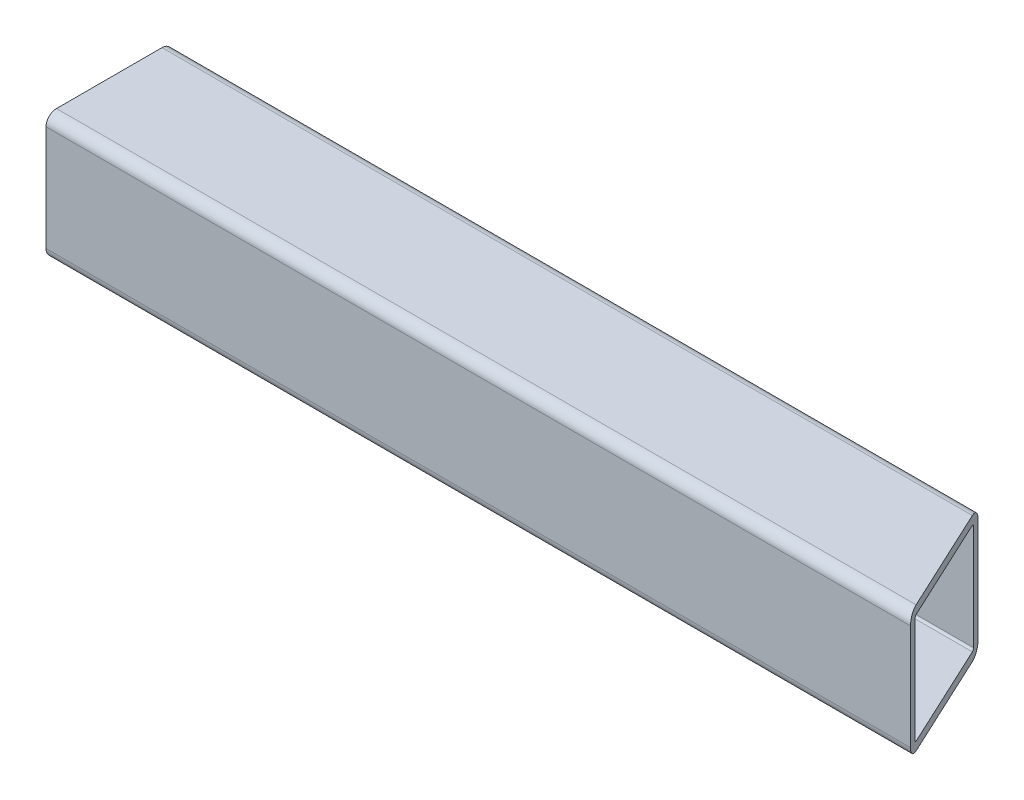
ISO-10303-21;
HEADER;
FILE_DESCRIPTION(('STEP AP214'),'2;1');
FILE_NAME('part.step','',(''),(''),'','','');
FILE_SCHEMA(('AUTOMOTIVE_DESIGN { 1 0 10303 214 1 1 1 1 }'));
ENDSEC;
DATA;
#1=APPLICATION_CONTEXT('core data for automotive mechanical design processes');
#2=APPLICATION_PROTOCOL_DEFINITION('international standard','automotive_design',2000,#1);
#3=PRODUCT_CONTEXT('',#1,'mechanical');
#4=PRODUCT('Part','Part','',(#3));
#5=PRODUCT_RELATED_PRODUCT_CATEGORY('part','',(#4));
#6=PRODUCT_DEFINITION_FORMATION('','',#4);
#7=PRODUCT_DEFINITION_CONTEXT('part definition',#1,'design');
#8=PRODUCT_DEFINITION('design','',#6,#7);
#9=PRODUCT_DEFINITION_SHAPE('','',#8);
#10=(LENGTH_UNIT() NAMED_UNIT(*) SI_UNIT(.MILLI.,.METRE.));
#11=(NAMED_UNIT(*) PLANE_ANGLE_UNIT() SI_UNIT($,.RADIAN.));
#12=(NAMED_UNIT(*) SI_UNIT($,.STERADIAN.) SOLID_ANGLE_UNIT());
#13=UNCERTAINTY_MEASURE_WITH_UNIT(LENGTH_MEASURE(1.E-05),#10,'distance_accuracy_value','');
#14=(GEOMETRIC_REPRESENTATION_CONTEXT(3) GLOBAL_UNCERTAINTY_ASSIGNED_CONTEXT((#13)) GLOBAL_UNIT_ASSIGNED_CONTEXT((#10,
#11,#12)) REPRESENTATION_CONTEXT('',''));
#15=CARTESIAN_POINT('',(0.,0.,0.));
#16=DIRECTION('',(0.,0.,1.));
#17=DIRECTION('',(1.,0.,0.));
#18=AXIS2_PLACEMENT_3D('',#15,#16,#17);
#19=CARTESIAN_POINT('',(-130.175,-15.875,15.875));
#20=DIRECTION('',(1.,0.,0.));
#21=DIRECTION('',(0.,0.,-1.));
#22=AXIS2_PLACEMENT_3D('',#19,#20,#21);
#23=PLANE('',#22);
#24=CARTESIAN_POINT('',(-130.175,-15.875,15.875));
#25=DIRECTION('',(1.,0.,0.));
#26=DIRECTION('',(0.,0.,-1.));
#27=AXIS2_PLACEMENT_3D('',#24,#25,#26);
#28=CIRCLE('',#27,3.175);
#29=CARTESIAN_POINT('',(-130.175,-15.875,19.05));
#30=VERTEX_POINT('',#29);
#31=CARTESIAN_POINT('',(-130.175,-19.05,15.875));
#32=VERTEX_POINT('',#31);
#33=EDGE_CURVE('E224',#30,#32,#28,.T.);
#34=ORIENTED_EDGE('',*,*,#33,.F.);
#35=DIRECTION('',(0.,-1.,0.));
#36=VECTOR('',#35,1.);
#37=CARTESIAN_POINT('',(-130.175,15.875,19.05));
#38=LINE('',#37,#36);
#39=CARTESIAN_POINT('',(-130.175,15.875,19.05));
#40=VERTEX_POINT('',#39);
#41=EDGE_CURVE('E203',#40,#30,#38,.T.);
#42=ORIENTED_EDGE('',*,*,#41,.F.);
#43=CARTESIAN_POINT('',(-130.175,15.875,15.875));
#44=DIRECTION('',(1.,0.,0.));
#45=DIRECTION('',(0.,0.,-1.));
#46=AXIS2_PLACEMENT_3D('',#43,#44,#45);
#47=CIRCLE('',#46,3.175);
#48=CARTESIAN_POINT('',(-130.175,19.05,15.875));
#49=VERTEX_POINT('',#48);
#50=EDGE_CURVE('E218',#49,#40,#47,.T.);
#51=ORIENTED_EDGE('',*,*,#50,.F.);
#52=DIRECTION('',(0.,0.,1.));
#53=VECTOR('',#52,1.);
#54=CARTESIAN_POINT('',(-130.175,19.05,15.875));
#55=LINE('',#54,#53);
#56=CARTESIAN_POINT('',(-130.175,19.05,-15.875));
#57=VERTEX_POINT('',#56);
#58=EDGE_CURVE('E238',#57,#49,#55,.T.);
#59=ORIENTED_EDGE('',*,*,#58,.F.);
#60=CARTESIAN_POINT('',(-130.175,15.875,-15.875));
#61=DIRECTION('',(1.,0.,0.));
#62=DIRECTION('',(0.,0.,-1.));
#63=AXIS2_PLACEMENT_3D('',#60,#61,#62);
#64=CIRCLE('',#63,3.175);
#65=CARTESIAN_POINT('',(-130.175,15.875,-19.05));
#66=VERTEX_POINT('',#65);
#67=EDGE_CURVE('E235',#66,#57,#64,.T.);
#68=ORIENTED_EDGE('',*,*,#67,.F.);
#69=DIRECTION('',(0.,1.,0.));
#70=VECTOR('',#69,1.);
#71=CARTESIAN_POINT('',(-130.175,15.875,-19.05));
#72=LINE('',#71,#70);
#73=CARTESIAN_POINT('',(-130.175,-15.875,-19.05));
#74=VERTEX_POINT('',#73);
#75=EDGE_CURVE('E232',#74,#66,#72,.T.);
#76=ORIENTED_EDGE('',*,*,#75,.F.);
#77=CARTESIAN_POINT('',(-130.175,-15.875,-15.875));
#78=DIRECTION('',(1.,0.,0.));
#79=DIRECTION('',(0.,0.,-1.));
#80=AXIS2_PLACEMENT_3D('',#77,#78,#79);
#81=CIRCLE('',#80,3.175);
#82=CARTESIAN_POINT('',(-130.175,-19.05,-15.875));
#83=VERTEX_POINT('',#82);
#84=EDGE_CURVE('E229',#83,#74,#81,.T.);
#85=ORIENTED_EDGE('',*,*,#84,.F.);
#86=DIRECTION('',(0.,0.,-1.));
#87=VECTOR('',#86,1.);
#88=CARTESIAN_POINT('',(-130.175,-19.05,15.875));
#89=LINE('',#88,#87);
#90=EDGE_CURVE('E226',#32,#83,#89,.T.);
#91=ORIENTED_EDGE('',*,*,#90,.F.);
#92=EDGE_LOOP('',(#34,#42,#51,#59,#68,#76,#85,#91));
#93=FACE_BOUND('',#92,.T.);
#94=CARTESIAN_POINT('',(-130.175,-15.875,15.875));
#95=DIRECTION('',(1.,0.,0.));
#96=DIRECTION('',(0.,0.,-1.));
#97=AXIS2_PLACEMENT_3D('',#94,#95,#96);
#98=CIRCLE('',#97,0.635000000000002);
#99=CARTESIAN_POINT('',(-130.175,-15.875,16.51));
#100=VERTEX_POINT('',#99);
#101=CARTESIAN_POINT('',(-130.175,-16.51,15.875));
#102=VERTEX_POINT('',#101);
#103=EDGE_CURVE('E212',#100,#102,#98,.T.);
#104=ORIENTED_EDGE('',*,*,#103,.T.);
#105=DIRECTION('',(0.,0.,-1.));
#106=VECTOR('',#105,1.);
#107=CARTESIAN_POINT('',(-130.175,-16.51,15.875));
#108=LINE('',#107,#106);
#109=CARTESIAN_POINT('',(-130.175,-16.51,-15.875));
#110=VERTEX_POINT('',#109);
#111=EDGE_CURVE('E268',#102,#110,#108,.T.);
#112=ORIENTED_EDGE('',*,*,#111,.T.);
#113=CARTESIAN_POINT('',(-130.175,-15.875,-15.875));
#114=DIRECTION('',(1.,0.,0.));
#115=DIRECTION('',(0.,0.,-1.));
#116=AXIS2_PLACEMENT_3D('',#113,#114,#115);
#117=CIRCLE('',#116,0.634999999999999);
#118=CARTESIAN_POINT('',(-130.175,-15.875,-16.51));
#119=VERTEX_POINT('',#118);
#120=EDGE_CURVE('E271',#110,#119,#117,.T.);
#121=ORIENTED_EDGE('',*,*,#120,.T.);
#122=DIRECTION('',(0.,1.,0.));
#123=VECTOR('',#122,1.);
#124=CARTESIAN_POINT('',(-130.175,15.875,-16.51));
#125=LINE('',#124,#123);
#126=CARTESIAN_POINT('',(-130.175,15.875,-16.51));
#127=VERTEX_POINT('',#126);
#128=EDGE_CURVE('E274',#119,#127,#125,.T.);
#129=ORIENTED_EDGE('',*,*,#128,.T.);
#130=CARTESIAN_POINT('',(-130.175,15.875,-15.875));
#131=DIRECTION('',(1.,0.,0.));
#132=DIRECTION('',(0.,0.,-1.));
#133=AXIS2_PLACEMENT_3D('',#130,#131,#132);
#134=CIRCLE('',#133,0.635000000000004);
#135=CARTESIAN_POINT('',(-130.175,16.51,-15.875));
#136=VERTEX_POINT('',#135);
#137=EDGE_CURVE('E277',#127,#136,#134,.T.);
#138=ORIENTED_EDGE('',*,*,#137,.T.);
#139=DIRECTION('',(0.,0.,1.));
#140=VECTOR('',#139,1.);
#141=CARTESIAN_POINT('',(-130.175,16.51,15.875));
#142=LINE('',#141,#140);
#143=CARTESIAN_POINT('',(-130.175,16.51,15.875));
#144=VERTEX_POINT('',#143);
#145=EDGE_CURVE('E280',#136,#144,#142,.T.);
#146=ORIENTED_EDGE('',*,*,#145,.T.);
#147=CARTESIAN_POINT('',(-130.175,15.875,15.875));
#148=DIRECTION('',(1.,0.,0.));
#149=DIRECTION('',(0.,0.,-1.));
#150=AXIS2_PLACEMENT_3D('',#147,#148,#149);
#151=CIRCLE('',#150,0.635000000000004);
#152=CARTESIAN_POINT('',(-130.175,15.875,16.51));
#153=VERTEX_POINT('',#152);
#154=EDGE_CURVE('E283',#144,#153,#151,.T.);
#155=ORIENTED_EDGE('',*,*,#154,.T.);
#156=DIRECTION('',(0.,-1.,0.));
#157=VECTOR('',#156,1.);
#158=CARTESIAN_POINT('',(-130.175,15.875,16.51));
#159=LINE('',#158,#157);
#160=EDGE_CURVE('E286',#153,#100,#159,.T.);
#161=ORIENTED_EDGE('',*,*,#160,.T.);
#162=EDGE_LOOP('',(#104,#112,#121,#129,#138,#146,#155,#161));
#163=FACE_BOUND('',#162,.T.);
#164=ADVANCED_FACE('F81',(#93,#163),#23,.F.);
#165=CARTESIAN_POINT('',(130.175,-15.875,15.875));
#166=DIRECTION('',(-1.,0.,0.));
#167=DIRECTION('',(0.,0.,1.));
#168=AXIS2_PLACEMENT_3D('',#165,#166,#167);
#169=CYLINDRICAL_SURFACE('',#168,3.175);
#170=DIRECTION('',(-1.,0.,0.));
#171=VECTOR('',#170,1.);
#172=CARTESIAN_POINT('',(130.175,-19.05,15.875));
#173=LINE('',#172,#171);
#174=CARTESIAN_POINT('',(128.694473185358,-19.05,15.875));
#175=VERTEX_POINT('',#174);
#176=EDGE_CURVE('E89',#175,#32,#173,.T.);
#177=ORIENTED_EDGE('',*,*,#176,.F.);
#178=CARTESIAN_POINT('',(128.694473185358,-15.875,15.875));
#179=DIRECTION('',(-0.906307787036652,0.,0.422618261740694));
#180=DIRECTION('',(-0.422618261740694,0.,-0.906307787036652));
#181=AXIS2_PLACEMENT_3D('',#178,#179,#180);
#182=ELLIPSE('',#181,3.5032248927059,3.175);
#183=CARTESIAN_POINT('',(130.175,-15.875,19.05));
#184=VERTEX_POINT('',#183);
#185=EDGE_CURVE('E210',#175,#184,#182,.T.);
#186=ORIENTED_EDGE('',*,*,#185,.T.);
#187=DIRECTION('',(-1.,0.,0.));
#188=VECTOR('',#187,1.);
#189=CARTESIAN_POINT('',(130.175,-15.875,19.05));
#190=LINE('',#189,#188);
#191=EDGE_CURVE('E195',#184,#30,#190,.T.);
#192=ORIENTED_EDGE('',*,*,#191,.T.);
#193=ORIENTED_EDGE('',*,*,#33,.T.);
#194=EDGE_LOOP('',(#177,#186,#192,#193));
#195=FACE_BOUND('',#194,.T.);
#196=ADVANCED_FACE('F83',(#195),#169,.T.);
#197=CARTESIAN_POINT('',(130.175,-19.05,15.875));
#198=DIRECTION('',(0.,1.,0.));
#199=DIRECTION('',(0.,0.,1.));
#200=AXIS2_PLACEMENT_3D('',#197,#198,#199);
#201=PLANE('',#200);
#202=DIRECTION('',(-1.,0.,0.));
#203=VECTOR('',#202,1.);
#204=CARTESIAN_POINT('',(130.175,-19.05,-15.875));
#205=LINE('',#204,#203);
#206=CARTESIAN_POINT('',(113.889205038937,-19.05,-15.875));
#207=VERTEX_POINT('',#206);
#208=EDGE_CURVE('E251',#207,#83,#205,.T.);
#209=ORIENTED_EDGE('',*,*,#208,.F.);
#210=DIRECTION('',(0.422618261740694,0.,0.906307787036652));
#211=VECTOR('',#210,1.);
#212=CARTESIAN_POINT('',(128.958904446549,-19.05,16.4420746696226));
#213=LINE('',#212,#211);
#214=EDGE_CURVE('E96',#207,#175,#213,.T.);
#215=ORIENTED_EDGE('',*,*,#214,.T.);
#216=ORIENTED_EDGE('',*,*,#176,.T.);
#217=ORIENTED_EDGE('',*,*,#90,.T.);
#218=EDGE_LOOP('',(#209,#215,#216,#217));
#219=FACE_BOUND('',#218,.T.);
#220=ADVANCED_FACE('F253',(#219),#201,.F.);
#221=CARTESIAN_POINT('',(130.175,-15.875,-15.875));
#222=DIRECTION('',(-1.,0.,0.));
#223=DIRECTION('',(0.,0.,1.));
#224=AXIS2_PLACEMENT_3D('',#221,#222,#223);
#225=CYLINDRICAL_SURFACE('',#224,3.175);
#226=DIRECTION('',(-1.,0.,0.));
#227=VECTOR('',#226,1.);
#228=CARTESIAN_POINT('',(130.175,-15.875,-19.05));
#229=LINE('',#228,#227);
#230=CARTESIAN_POINT('',(112.408678224295,-15.875,-19.05));
#231=VERTEX_POINT('',#230);
#232=EDGE_CURVE('E249',#231,#74,#229,.T.);
#233=ORIENTED_EDGE('',*,*,#232,.F.);
#234=CARTESIAN_POINT('',(113.889205038937,-15.875,-15.875));
#235=DIRECTION('',(-0.906307787036652,0.,0.422618261740694));
#236=DIRECTION('',(-0.422618261740694,0.,-0.906307787036652));
#237=AXIS2_PLACEMENT_3D('',#234,#235,#236);
#238=ELLIPSE('',#237,3.5032248927059,3.175);
#239=EDGE_CURVE('E104',#231,#207,#238,.T.);
#240=ORIENTED_EDGE('',*,*,#239,.T.);
#241=ORIENTED_EDGE('',*,*,#208,.T.);
#242=ORIENTED_EDGE('',*,*,#84,.T.);
#243=EDGE_LOOP('',(#233,#240,#241,#242));
#244=FACE_BOUND('',#243,.T.);
#245=ADVANCED_FACE('F259',(#244),#225,.T.);
#246=CARTESIAN_POINT('',(130.175,15.875,-19.05));
#247=DIRECTION('',(0.,0.,1.));
#248=DIRECTION('',(0.,-1.,0.));
#249=AXIS2_PLACEMENT_3D('',#246,#247,#248);
#250=PLANE('',#249);
#251=DIRECTION('',(-1.,0.,0.));
#252=VECTOR('',#251,1.);
#253=CARTESIAN_POINT('',(130.175,15.875,-19.05));
#254=LINE('',#253,#252);
#255=CARTESIAN_POINT('',(112.408678224295,15.875,-19.05));
#256=VERTEX_POINT('',#255);
#257=EDGE_CURVE('E247',#256,#66,#254,.T.);
#258=ORIENTED_EDGE('',*,*,#257,.F.);
#259=DIRECTION('',(0.,-1.,0.));
#260=VECTOR('',#259,1.);
#261=CARTESIAN_POINT('',(112.408678224295,399.008939970401,-19.05));
#262=LINE('',#261,#260);
#263=EDGE_CURVE('E337',#256,#231,#262,.T.);
#264=ORIENTED_EDGE('',*,*,#263,.T.);
#265=ORIENTED_EDGE('',*,*,#232,.T.);
#266=ORIENTED_EDGE('',*,*,#75,.T.);
#267=EDGE_LOOP('',(#258,#264,#265,#266));
#268=FACE_BOUND('',#267,.T.);
#269=ADVANCED_FACE('F336',(#268),#250,.F.);
#270=CARTESIAN_POINT('',(130.175,15.875,-15.875));
#271=DIRECTION('',(-1.,0.,0.));
#272=DIRECTION('',(0.,0.,1.));
#273=AXIS2_PLACEMENT_3D('',#270,#271,#272);
#274=CYLINDRICAL_SURFACE('',#273,3.175);
#275=DIRECTION('',(-1.,0.,0.));
#276=VECTOR('',#275,1.);
#277=CARTESIAN_POINT('',(130.175,19.05,-15.875));
#278=LINE('',#277,#276);
#279=CARTESIAN_POINT('',(113.889205038937,19.05,-15.875));
#280=VERTEX_POINT('',#279);
#281=EDGE_CURVE('E245',#280,#57,#278,.T.);
#282=ORIENTED_EDGE('',*,*,#281,.F.);
#283=CARTESIAN_POINT('',(113.889205038937,15.875,-15.875));
#284=DIRECTION('',(-0.906307787036652,0.,0.422618261740694));
#285=DIRECTION('',(-0.422618261740694,0.,-0.906307787036652));
#286=AXIS2_PLACEMENT_3D('',#283,#284,#285);
#287=ELLIPSE('',#286,3.50322489270591,3.175);
#288=EDGE_CURVE('E262',#280,#256,#287,.T.);
#289=ORIENTED_EDGE('',*,*,#288,.T.);
#290=ORIENTED_EDGE('',*,*,#257,.T.);
#291=ORIENTED_EDGE('',*,*,#67,.T.);
#292=EDGE_LOOP('',(#282,#289,#290,#291));
#293=FACE_BOUND('',#292,.T.);
#294=ADVANCED_FACE('F334',(#293),#274,.T.);
#295=CARTESIAN_POINT('',(130.175,19.05,15.875));
#296=DIRECTION('',(0.,-1.,0.));
#297=DIRECTION('',(0.,0.,-1.));
#298=AXIS2_PLACEMENT_3D('',#295,#296,#297);
#299=PLANE('',#298);
#300=DIRECTION('',(-1.,0.,0.));
#301=VECTOR('',#300,1.);
#302=CARTESIAN_POINT('',(130.175,19.05,15.875));
#303=LINE('',#302,#301);
#304=CARTESIAN_POINT('',(128.694473185358,19.05,15.875));
#305=VERTEX_POINT('',#304);
#306=EDGE_CURVE('E243',#305,#49,#303,.T.);
#307=ORIENTED_EDGE('',*,*,#306,.F.);
#308=DIRECTION('',(-0.422618261740694,0.,-0.906307787036652));
#309=VECTOR('',#308,1.);
#310=CARTESIAN_POINT('',(128.958904446549,19.05,16.4420746696226));
#311=LINE('',#310,#309);
#312=EDGE_CURVE('E324',#305,#280,#311,.T.);
#313=ORIENTED_EDGE('',*,*,#312,.T.);
#314=ORIENTED_EDGE('',*,*,#281,.T.);
#315=ORIENTED_EDGE('',*,*,#58,.T.);
#316=EDGE_LOOP('',(#307,#313,#314,#315));
#317=FACE_BOUND('',#316,.T.);
#318=ADVANCED_FACE('F388',(#317),#299,.F.);
#319=CARTESIAN_POINT('',(130.175,15.875,15.875));
#320=DIRECTION('',(-1.,0.,0.));
#321=DIRECTION('',(0.,0.,1.));
#322=AXIS2_PLACEMENT_3D('',#319,#320,#321);
#323=CYLINDRICAL_SURFACE('',#322,3.175);
#324=DIRECTION('',(-1.,0.,0.));
#325=VECTOR('',#324,1.);
#326=CARTESIAN_POINT('',(130.175,15.875,19.05));
#327=LINE('',#326,#325);
#328=CARTESIAN_POINT('',(130.175,15.875,19.05));
#329=VERTEX_POINT('',#328);
#330=EDGE_CURVE('E207',#329,#40,#327,.T.);
#331=ORIENTED_EDGE('',*,*,#330,.F.);
#332=CARTESIAN_POINT('',(128.694473185358,15.875,15.875));
#333=DIRECTION('',(-0.906307787036652,0.,0.422618261740694));
#334=DIRECTION('',(-0.422618261740694,0.,-0.906307787036652));
#335=AXIS2_PLACEMENT_3D('',#332,#333,#334);
#336=ELLIPSE('',#335,3.50322489270591,3.175);
#337=EDGE_CURVE('E216',#329,#305,#336,.T.);
#338=ORIENTED_EDGE('',*,*,#337,.T.);
#339=ORIENTED_EDGE('',*,*,#306,.T.);
#340=ORIENTED_EDGE('',*,*,#50,.T.);
#341=EDGE_LOOP('',(#331,#338,#339,#340));
#342=FACE_BOUND('',#341,.T.);
#343=ADVANCED_FACE('F385',(#342),#323,.T.);
#344=CARTESIAN_POINT('',(130.175,15.875,19.05));
#345=DIRECTION('',(0.,0.,-1.));
#346=DIRECTION('',(0.,1.,0.));
#347=AXIS2_PLACEMENT_3D('',#344,#345,#346);
#348=PLANE('',#347);
#349=ORIENTED_EDGE('',*,*,#41,.T.);
#350=ORIENTED_EDGE('',*,*,#191,.F.);
#351=DIRECTION('',(0.,-1.,0.));
#352=VECTOR('',#351,1.);
#353=CARTESIAN_POINT('',(130.175,15.875,19.05));
#354=LINE('',#353,#352);
#355=EDGE_CURVE('E200',#329,#184,#354,.T.);
#356=ORIENTED_EDGE('',*,*,#355,.F.);
#357=ORIENTED_EDGE('',*,*,#330,.T.);
#358=EDGE_LOOP('',(#349,#350,#356,#357));
#359=FACE_BOUND('',#358,.T.);
#360=ADVANCED_FACE('F197',(#359),#348,.F.);
#361=CARTESIAN_POINT('',(130.175,-15.875,15.875));
#362=DIRECTION('',(-1.,0.,0.));
#363=DIRECTION('',(0.,0.,1.));
#364=AXIS2_PLACEMENT_3D('',#361,#362,#363);
#365=CYLINDRICAL_SURFACE('',#364,0.635000000000002);
#366=CARTESIAN_POINT('',(128.694473185358,-15.875,15.875));
#367=DIRECTION('',(-0.906307787036652,0.,0.422618261740694));
#368=DIRECTION('',(-0.422618261740694,0.,-0.906307787036652));
#369=AXIS2_PLACEMENT_3D('',#366,#367,#368);
#370=ELLIPSE('',#369,0.700644978541183,0.635000000000002);
#371=CARTESIAN_POINT('',(128.694473185358,-16.51,15.875));
#372=VERTEX_POINT('',#371);
#373=CARTESIAN_POINT('',(128.990578548286,-15.875,16.51));
#374=VERTEX_POINT('',#373);
#375=EDGE_CURVE('E311',#372,#374,#370,.T.);
#376=ORIENTED_EDGE('',*,*,#375,.F.);
#377=DIRECTION('',(-1.,0.,0.));
#378=VECTOR('',#377,1.);
#379=CARTESIAN_POINT('',(130.175,-16.51,15.875));
#380=LINE('',#379,#378);
#381=EDGE_CURVE('E222',#372,#102,#380,.T.);
#382=ORIENTED_EDGE('',*,*,#381,.T.);
#383=ORIENTED_EDGE('',*,*,#103,.F.);
#384=DIRECTION('',(-1.,0.,0.));
#385=VECTOR('',#384,1.);
#386=CARTESIAN_POINT('',(130.175,-15.875,16.51));
#387=LINE('',#386,#385);
#388=EDGE_CURVE('E289',#374,#100,#387,.T.);
#389=ORIENTED_EDGE('',*,*,#388,.F.);
#390=EDGE_LOOP('',(#376,#382,#383,#389));
#391=FACE_BOUND('',#390,.T.);
#392=ADVANCED_FACE('F308',(#391),#365,.F.);
#393=CARTESIAN_POINT('',(130.175,-16.51,15.875));
#394=DIRECTION('',(0.,1.,0.));
#395=DIRECTION('',(0.,0.,1.));
#396=AXIS2_PLACEMENT_3D('',#393,#394,#395);
#397=PLANE('',#396);
#398=DIRECTION('',(0.422618261740694,0.,0.906307787036652));
#399=VECTOR('',#398,1.);
#400=CARTESIAN_POINT('',(128.958904446549,-16.51,16.4420746696226));
#401=LINE('',#400,#399);
#402=CARTESIAN_POINT('',(113.889205038937,-16.51,-15.875));
#403=VERTEX_POINT('',#402);
#404=EDGE_CURVE('E322',#403,#372,#401,.T.);
#405=ORIENTED_EDGE('',*,*,#404,.F.);
#406=DIRECTION('',(-1.,0.,0.));
#407=VECTOR('',#406,1.);
#408=CARTESIAN_POINT('',(130.175,-16.51,-15.875));
#409=LINE('',#408,#407);
#410=EDGE_CURVE('E300',#403,#110,#409,.T.);
#411=ORIENTED_EDGE('',*,*,#410,.T.);
#412=ORIENTED_EDGE('',*,*,#111,.F.);
#413=ORIENTED_EDGE('',*,*,#381,.F.);
#414=EDGE_LOOP('',(#405,#411,#412,#413));
#415=FACE_BOUND('',#414,.T.);
#416=ADVANCED_FACE('F313',(#415),#397,.T.);
#417=CARTESIAN_POINT('',(130.175,-15.875,-15.875));
#418=DIRECTION('',(-1.,0.,0.));
#419=DIRECTION('',(0.,0.,1.));
#420=AXIS2_PLACEMENT_3D('',#417,#418,#419);
#421=CYLINDRICAL_SURFACE('',#420,0.634999999999999);
#422=CARTESIAN_POINT('',(113.889205038937,-15.875,-15.875));
#423=DIRECTION('',(-0.906307787036652,0.,0.422618261740694));
#424=DIRECTION('',(-0.422618261740694,0.,-0.906307787036652));
#425=AXIS2_PLACEMENT_3D('',#422,#423,#424);
#426=ELLIPSE('',#425,0.700644978541179,0.634999999999999);
#427=CARTESIAN_POINT('',(113.593099676009,-15.875,-16.51));
#428=VERTEX_POINT('',#427);
#429=EDGE_CURVE('E326',#428,#403,#426,.T.);
#430=ORIENTED_EDGE('',*,*,#429,.F.);
#431=DIRECTION('',(-1.,0.,0.));
#432=VECTOR('',#431,1.);
#433=CARTESIAN_POINT('',(130.175,-15.875,-16.51));
#434=LINE('',#433,#432);
#435=EDGE_CURVE('E299',#428,#119,#434,.T.);
#436=ORIENTED_EDGE('',*,*,#435,.T.);
#437=ORIENTED_EDGE('',*,*,#120,.F.);
#438=ORIENTED_EDGE('',*,*,#410,.F.);
#439=EDGE_LOOP('',(#430,#436,#437,#438));
#440=FACE_BOUND('',#439,.T.);
#441=ADVANCED_FACE('F352',(#440),#421,.F.);
#442=CARTESIAN_POINT('',(130.175,15.875,-16.51));
#443=DIRECTION('',(0.,0.,1.));
#444=DIRECTION('',(0.,-1.,0.));
#445=AXIS2_PLACEMENT_3D('',#442,#443,#444);
#446=PLANE('',#445);
#447=DIRECTION('',(0.,-1.,0.));
#448=VECTOR('',#447,1.);
#449=CARTESIAN_POINT('',(113.593099676009,15.875,-16.51));
#450=LINE('',#449,#448);
#451=CARTESIAN_POINT('',(113.593099676009,15.875,-16.51));
#452=VERTEX_POINT('',#451);
#453=EDGE_CURVE('E348',#452,#428,#450,.T.);
#454=ORIENTED_EDGE('',*,*,#453,.F.);
#455=DIRECTION('',(-1.,0.,0.));
#456=VECTOR('',#455,1.);
#457=CARTESIAN_POINT('',(130.175,15.875,-16.51));
#458=LINE('',#457,#456);
#459=EDGE_CURVE('E297',#452,#127,#458,.T.);
#460=ORIENTED_EDGE('',*,*,#459,.T.);
#461=ORIENTED_EDGE('',*,*,#128,.F.);
#462=ORIENTED_EDGE('',*,*,#435,.F.);
#463=EDGE_LOOP('',(#454,#460,#461,#462));
#464=FACE_BOUND('',#463,.T.);
#465=ADVANCED_FACE('F355',(#464),#446,.T.);
#466=CARTESIAN_POINT('',(130.175,15.875,-15.875));
#467=DIRECTION('',(-1.,0.,0.));
#468=DIRECTION('',(0.,0.,1.));
#469=AXIS2_PLACEMENT_3D('',#466,#467,#468);
#470=CYLINDRICAL_SURFACE('',#469,0.635000000000004);
#471=CARTESIAN_POINT('',(113.889205038937,15.875,-15.875));
#472=DIRECTION('',(-0.906307787036652,0.,0.422618261740694));
#473=DIRECTION('',(-0.422618261740694,0.,-0.906307787036652));
#474=AXIS2_PLACEMENT_3D('',#471,#472,#473);
#475=ELLIPSE('',#474,0.700644978541185,0.635000000000004);
#476=CARTESIAN_POINT('',(113.889205038937,16.51,-15.875));
#477=VERTEX_POINT('',#476);
#478=EDGE_CURVE('E345',#477,#452,#475,.T.);
#479=ORIENTED_EDGE('',*,*,#478,.F.);
#480=DIRECTION('',(-1.,0.,0.));
#481=VECTOR('',#480,1.);
#482=CARTESIAN_POINT('',(130.175,16.51,-15.875));
#483=LINE('',#482,#481);
#484=EDGE_CURVE('E295',#477,#136,#483,.T.);
#485=ORIENTED_EDGE('',*,*,#484,.T.);
#486=ORIENTED_EDGE('',*,*,#137,.F.);
#487=ORIENTED_EDGE('',*,*,#459,.F.);
#488=EDGE_LOOP('',(#479,#485,#486,#487));
#489=FACE_BOUND('',#488,.T.);
#490=ADVANCED_FACE('F360',(#489),#470,.F.);
#491=CARTESIAN_POINT('',(130.175,16.51,15.875));
#492=DIRECTION('',(0.,-1.,0.));
#493=DIRECTION('',(0.,0.,-1.));
#494=AXIS2_PLACEMENT_3D('',#491,#492,#493);
#495=PLANE('',#494);
#496=DIRECTION('',(-0.422618261740694,0.,-0.906307787036652));
#497=VECTOR('',#496,1.);
#498=CARTESIAN_POINT('',(128.958904446549,16.51,16.4420746696226));
#499=LINE('',#498,#497);
#500=CARTESIAN_POINT('',(128.694473185358,16.51,15.875));
#501=VERTEX_POINT('',#500);
#502=EDGE_CURVE('E340',#501,#477,#499,.T.);
#503=ORIENTED_EDGE('',*,*,#502,.F.);
#504=DIRECTION('',(-1.,0.,0.));
#505=VECTOR('',#504,1.);
#506=CARTESIAN_POINT('',(130.175,16.51,15.875));
#507=LINE('',#506,#505);
#508=EDGE_CURVE('E293',#501,#144,#507,.T.);
#509=ORIENTED_EDGE('',*,*,#508,.T.);
#510=ORIENTED_EDGE('',*,*,#145,.F.);
#511=ORIENTED_EDGE('',*,*,#484,.F.);
#512=EDGE_LOOP('',(#503,#509,#510,#511));
#513=FACE_BOUND('',#512,.T.);
#514=ADVANCED_FACE('F363',(#513),#495,.T.);
#515=CARTESIAN_POINT('',(130.175,15.875,15.875));
#516=DIRECTION('',(-1.,0.,0.));
#517=DIRECTION('',(0.,0.,1.));
#518=AXIS2_PLACEMENT_3D('',#515,#516,#517);
#519=CYLINDRICAL_SURFACE('',#518,0.635000000000004);
#520=CARTESIAN_POINT('',(128.694473185358,15.875,15.875));
#521=DIRECTION('',(-0.906307787036652,0.,0.422618261740694));
#522=DIRECTION('',(-0.422618261740694,0.,-0.906307787036652));
#523=AXIS2_PLACEMENT_3D('',#520,#521,#522);
#524=ELLIPSE('',#523,0.700644978541185,0.635000000000004);
#525=CARTESIAN_POINT('',(128.990578548286,15.875,16.51));
#526=VERTEX_POINT('',#525);
#527=EDGE_CURVE('E338',#526,#501,#524,.T.);
#528=ORIENTED_EDGE('',*,*,#527,.F.);
#529=DIRECTION('',(-1.,0.,0.));
#530=VECTOR('',#529,1.);
#531=CARTESIAN_POINT('',(130.175,15.875,16.51));
#532=LINE('',#531,#530);
#533=EDGE_CURVE('E291',#526,#153,#532,.T.);
#534=ORIENTED_EDGE('',*,*,#533,.T.);
#535=ORIENTED_EDGE('',*,*,#154,.F.);
#536=ORIENTED_EDGE('',*,*,#508,.F.);
#537=EDGE_LOOP('',(#528,#534,#535,#536));
#538=FACE_BOUND('',#537,.T.);
#539=ADVANCED_FACE('F366',(#538),#519,.F.);
#540=CARTESIAN_POINT('',(130.175,15.875,16.51));
#541=DIRECTION('',(0.,0.,-1.));
#542=DIRECTION('',(0.,1.,0.));
#543=AXIS2_PLACEMENT_3D('',#540,#541,#542);
#544=PLANE('',#543);
#545=DIRECTION('',(0.,1.,0.));
#546=VECTOR('',#545,1.);
#547=CARTESIAN_POINT('',(128.990578548286,15.875,16.51));
#548=LINE('',#547,#546);
#549=EDGE_CURVE('E12',#374,#526,#548,.T.);
#550=ORIENTED_EDGE('',*,*,#549,.F.);
#551=ORIENTED_EDGE('',*,*,#388,.T.);
#552=ORIENTED_EDGE('',*,*,#160,.F.);
#553=ORIENTED_EDGE('',*,*,#533,.F.);
#554=EDGE_LOOP('',(#550,#551,#552,#553));
#555=FACE_BOUND('',#554,.T.);
#556=ADVANCED_FACE('F317',(#555),#544,.T.);
#557=CARTESIAN_POINT('',(130.175,399.008939970401,19.05));
#558=DIRECTION('',(-0.906307787036652,0.,0.422618261740694));
#559=DIRECTION('',(0.422618261740694,0.,0.906307787036652));
#560=AXIS2_PLACEMENT_3D('',#557,#558,#559);
#561=PLANE('',#560);
#562=ORIENTED_EDGE('',*,*,#404,.T.);
#563=ORIENTED_EDGE('',*,*,#375,.T.);
#564=ORIENTED_EDGE('',*,*,#549,.T.);
#565=ORIENTED_EDGE('',*,*,#527,.T.);
#566=ORIENTED_EDGE('',*,*,#502,.T.);
#567=ORIENTED_EDGE('',*,*,#478,.T.);
#568=ORIENTED_EDGE('',*,*,#453,.T.);
#569=ORIENTED_EDGE('',*,*,#429,.T.);
#570=EDGE_LOOP('',(#562,#563,#564,#565,#566,#567,#568,#569));
#571=FACE_BOUND('',#570,.T.);
#572=ORIENTED_EDGE('',*,*,#185,.F.);
#573=ORIENTED_EDGE('',*,*,#214,.F.);
#574=ORIENTED_EDGE('',*,*,#239,.F.);
#575=ORIENTED_EDGE('',*,*,#263,.F.);
#576=ORIENTED_EDGE('',*,*,#288,.F.);
#577=ORIENTED_EDGE('',*,*,#312,.F.);
#578=ORIENTED_EDGE('',*,*,#337,.F.);
#579=ORIENTED_EDGE('',*,*,#355,.T.);
#580=EDGE_LOOP('',(#572,#573,#574,#575,#576,#577,#578,#579));
#581=FACE_BOUND('',#580,.T.);
#582=ADVANCED_FACE('F214',(#571,#581),#561,.F.);
#583=CLOSED_SHELL('',(#164,#196,#220,#245,#269,#294,#318,#343,#360,#392,#416,#441,#465,#490,
#514,#539,#556,#582));
#584=MANIFOLD_SOLID_BREP('B2',#583);
#585=ADVANCED_BREP_SHAPE_REPRESENTATION('',(#18,#584),#14);
#586=SHAPE_DEFINITION_REPRESENTATION(#9,#585);
ENDSEC;
END-ISO-10303-21;
